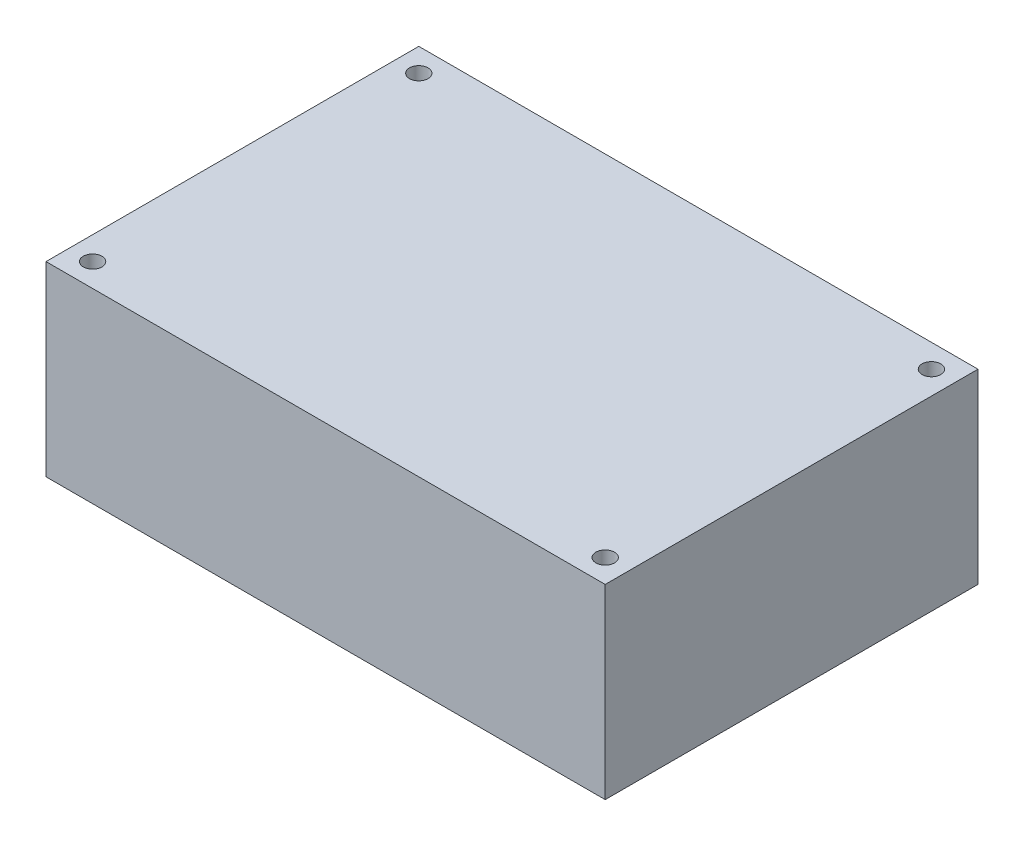
ISO-10303-21;
HEADER;
FILE_DESCRIPTION(('STEP AP214'),'2;1');
FILE_NAME('part.step','',(''),(''),'','','');
FILE_SCHEMA(('AUTOMOTIVE_DESIGN { 1 0 10303 214 1 1 1 1 }'));
ENDSEC;
DATA;
#1=APPLICATION_CONTEXT('core data for automotive mechanical design processes');
#2=APPLICATION_PROTOCOL_DEFINITION('international standard','automotive_design',2000,#1);
#3=PRODUCT_CONTEXT('',#1,'mechanical');
#4=PRODUCT('Part','Part','',(#3));
#5=PRODUCT_RELATED_PRODUCT_CATEGORY('part','',(#4));
#6=PRODUCT_DEFINITION_FORMATION('','',#4);
#7=PRODUCT_DEFINITION_CONTEXT('part definition',#1,'design');
#8=PRODUCT_DEFINITION('design','',#6,#7);
#9=PRODUCT_DEFINITION_SHAPE('','',#8);
#10=(LENGTH_UNIT() NAMED_UNIT(*) SI_UNIT(.MILLI.,.METRE.));
#11=(NAMED_UNIT(*) PLANE_ANGLE_UNIT() SI_UNIT($,.RADIAN.));
#12=(NAMED_UNIT(*) SI_UNIT($,.STERADIAN.) SOLID_ANGLE_UNIT());
#13=UNCERTAINTY_MEASURE_WITH_UNIT(LENGTH_MEASURE(1.E-05),#10,'distance_accuracy_value','');
#14=(GEOMETRIC_REPRESENTATION_CONTEXT(3) GLOBAL_UNCERTAINTY_ASSIGNED_CONTEXT((#13)) GLOBAL_UNIT_ASSIGNED_CONTEXT((#10,
#11,#12)) REPRESENTATION_CONTEXT('',''));
#15=CARTESIAN_POINT('',(0.,0.,0.));
#16=DIRECTION('',(0.,0.,1.));
#17=DIRECTION('',(1.,0.,0.));
#18=AXIS2_PLACEMENT_3D('',#15,#16,#17);
#19=CARTESIAN_POINT('',(0.,20.,0.));
#20=DIRECTION('',(0.,1.,0.));
#21=DIRECTION('',(0.,0.,1.));
#22=AXIS2_PLACEMENT_3D('',#19,#20,#21);
#23=PLANE('',#22);
#24=CARTESIAN_POINT('',(27.5,20.,17.5));
#25=DIRECTION('',(0.,1.,0.));
#26=DIRECTION('',(0.,0.,1.));
#27=AXIS2_PLACEMENT_3D('',#24,#25,#26);
#28=CIRCLE('',#27,1.);
#29=CARTESIAN_POINT('',(27.5,20.,18.5));
#30=VERTEX_POINT('',#29);
#31=EDGE_CURVE('E129',#30,#30,#28,.T.);
#32=ORIENTED_EDGE('',*,*,#31,.F.);
#33=EDGE_LOOP('',(#32));
#34=FACE_BOUND('',#33,.T.);
#35=CARTESIAN_POINT('',(-27.5,20.,-17.5));
#36=DIRECTION('',(0.,1.,0.));
#37=DIRECTION('',(0.,0.,1.));
#38=AXIS2_PLACEMENT_3D('',#35,#36,#37);
#39=CIRCLE('',#38,1.);
#40=CARTESIAN_POINT('',(-27.5,20.,-16.5));
#41=VERTEX_POINT('',#40);
#42=EDGE_CURVE('E108',#41,#41,#39,.T.);
#43=ORIENTED_EDGE('',*,*,#42,.F.);
#44=EDGE_LOOP('',(#43));
#45=FACE_BOUND('',#44,.T.);
#46=DIRECTION('',(0.,0.,-1.));
#47=VECTOR('',#46,1.);
#48=CARTESIAN_POINT('',(30.,20.,-20.));
#49=LINE('',#48,#47);
#50=CARTESIAN_POINT('',(30.,20.,20.));
#51=VERTEX_POINT('',#50);
#52=CARTESIAN_POINT('',(30.,20.,-20.));
#53=VERTEX_POINT('',#52);
#54=EDGE_CURVE('E93',#51,#53,#49,.T.);
#55=ORIENTED_EDGE('',*,*,#54,.T.);
#56=DIRECTION('',(-1.,0.,0.));
#57=VECTOR('',#56,1.);
#58=CARTESIAN_POINT('',(-30.,20.,-20.));
#59=LINE('',#58,#57);
#60=CARTESIAN_POINT('',(-30.,20.,-20.));
#61=VERTEX_POINT('',#60);
#62=EDGE_CURVE('E88',#53,#61,#59,.T.);
#63=ORIENTED_EDGE('',*,*,#62,.T.);
#64=DIRECTION('',(0.,0.,1.));
#65=VECTOR('',#64,1.);
#66=CARTESIAN_POINT('',(-30.,20.,-20.));
#67=LINE('',#66,#65);
#68=CARTESIAN_POINT('',(-30.,20.,20.));
#69=VERTEX_POINT('',#68);
#70=EDGE_CURVE('E91',#61,#69,#67,.T.);
#71=ORIENTED_EDGE('',*,*,#70,.T.);
#72=DIRECTION('',(1.,0.,0.));
#73=VECTOR('',#72,1.);
#74=CARTESIAN_POINT('',(-30.,20.,20.));
#75=LINE('',#74,#73);
#76=EDGE_CURVE('E58',#69,#51,#75,.T.);
#77=ORIENTED_EDGE('',*,*,#76,.T.);
#78=EDGE_LOOP('',(#55,#63,#71,#77));
#79=FACE_BOUND('',#78,.T.);
#80=CARTESIAN_POINT('',(27.5,20.,-17.5));
#81=DIRECTION('',(0.,1.,0.));
#82=DIRECTION('',(0.,0.,1.));
#83=AXIS2_PLACEMENT_3D('',#80,#81,#82);
#84=CIRCLE('',#83,1.);
#85=CARTESIAN_POINT('',(27.5,20.,-16.5));
#86=VERTEX_POINT('',#85);
#87=EDGE_CURVE('E123',#86,#86,#84,.T.);
#88=ORIENTED_EDGE('',*,*,#87,.F.);
#89=EDGE_LOOP('',(#88));
#90=FACE_BOUND('',#89,.T.);
#91=CARTESIAN_POINT('',(-27.5,20.,17.5));
#92=DIRECTION('',(0.,1.,0.));
#93=DIRECTION('',(0.,0.,1.));
#94=AXIS2_PLACEMENT_3D('',#91,#92,#93);
#95=CIRCLE('',#94,1.);
#96=CARTESIAN_POINT('',(-27.5,20.,18.5));
#97=VERTEX_POINT('',#96);
#98=EDGE_CURVE('E135',#97,#97,#95,.T.);
#99=ORIENTED_EDGE('',*,*,#98,.F.);
#100=EDGE_LOOP('',(#99));
#101=FACE_BOUND('',#100,.T.);
#102=ADVANCED_FACE('F41',(#34,#45,#79,#90,#101),#23,.T.);
#103=CARTESIAN_POINT('',(0.,0.,0.));
#104=DIRECTION('',(0.,1.,0.));
#105=DIRECTION('',(0.,0.,1.));
#106=AXIS2_PLACEMENT_3D('',#103,#104,#105);
#107=PLANE('',#106);
#108=DIRECTION('',(0.,0.,-1.));
#109=VECTOR('',#108,1.);
#110=CARTESIAN_POINT('',(30.,0.,-20.));
#111=LINE('',#110,#109);
#112=CARTESIAN_POINT('',(30.,0.,20.));
#113=VERTEX_POINT('',#112);
#114=CARTESIAN_POINT('',(30.,0.,-20.));
#115=VERTEX_POINT('',#114);
#116=EDGE_CURVE('E105',#113,#115,#111,.T.);
#117=ORIENTED_EDGE('',*,*,#116,.F.);
#118=DIRECTION('',(1.,0.,0.));
#119=VECTOR('',#118,1.);
#120=CARTESIAN_POINT('',(-30.,0.,20.));
#121=LINE('',#120,#119);
#122=CARTESIAN_POINT('',(-30.,0.,20.));
#123=VERTEX_POINT('',#122);
#124=EDGE_CURVE('E81',#123,#113,#121,.T.);
#125=ORIENTED_EDGE('',*,*,#124,.F.);
#126=DIRECTION('',(0.,0.,1.));
#127=VECTOR('',#126,1.);
#128=CARTESIAN_POINT('',(-30.,0.,-20.));
#129=LINE('',#128,#127);
#130=CARTESIAN_POINT('',(-30.,0.,-20.));
#131=VERTEX_POINT('',#130);
#132=EDGE_CURVE('E75',#131,#123,#129,.T.);
#133=ORIENTED_EDGE('',*,*,#132,.F.);
#134=DIRECTION('',(-1.,0.,0.));
#135=VECTOR('',#134,1.);
#136=CARTESIAN_POINT('',(-30.,0.,-20.));
#137=LINE('',#136,#135);
#138=EDGE_CURVE('E97',#115,#131,#137,.T.);
#139=ORIENTED_EDGE('',*,*,#138,.F.);
#140=EDGE_LOOP('',(#117,#125,#133,#139));
#141=FACE_BOUND('',#140,.T.);
#142=CARTESIAN_POINT('',(-27.5,0.,-17.5));
#143=DIRECTION('',(0.,1.,0.));
#144=DIRECTION('',(0.,0.,1.));
#145=AXIS2_PLACEMENT_3D('',#142,#143,#144);
#146=CIRCLE('',#145,1.);
#147=CARTESIAN_POINT('',(-27.5,0.,-16.5));
#148=VERTEX_POINT('',#147);
#149=EDGE_CURVE('E120',#148,#148,#146,.T.);
#150=ORIENTED_EDGE('',*,*,#149,.T.);
#151=EDGE_LOOP('',(#150));
#152=FACE_BOUND('',#151,.T.);
#153=CARTESIAN_POINT('',(27.5,0.,-17.5));
#154=DIRECTION('',(0.,1.,0.));
#155=DIRECTION('',(0.,0.,1.));
#156=AXIS2_PLACEMENT_3D('',#153,#154,#155);
#157=CIRCLE('',#156,1.);
#158=CARTESIAN_POINT('',(27.5,0.,-16.5));
#159=VERTEX_POINT('',#158);
#160=EDGE_CURVE('E126',#159,#159,#157,.T.);
#161=ORIENTED_EDGE('',*,*,#160,.T.);
#162=EDGE_LOOP('',(#161));
#163=FACE_BOUND('',#162,.T.);
#164=CARTESIAN_POINT('',(27.5,0.,17.5));
#165=DIRECTION('',(0.,1.,0.));
#166=DIRECTION('',(0.,0.,1.));
#167=AXIS2_PLACEMENT_3D('',#164,#165,#166);
#168=CIRCLE('',#167,1.);
#169=CARTESIAN_POINT('',(27.5,0.,18.5));
#170=VERTEX_POINT('',#169);
#171=EDGE_CURVE('E132',#170,#170,#168,.T.);
#172=ORIENTED_EDGE('',*,*,#171,.T.);
#173=EDGE_LOOP('',(#172));
#174=FACE_BOUND('',#173,.T.);
#175=CARTESIAN_POINT('',(-27.5,0.,17.5));
#176=DIRECTION('',(0.,1.,0.));
#177=DIRECTION('',(0.,0.,1.));
#178=AXIS2_PLACEMENT_3D('',#175,#176,#177);
#179=CIRCLE('',#178,1.);
#180=CARTESIAN_POINT('',(-27.5,0.,18.5));
#181=VERTEX_POINT('',#180);
#182=EDGE_CURVE('E138',#181,#181,#179,.T.);
#183=ORIENTED_EDGE('',*,*,#182,.T.);
#184=EDGE_LOOP('',(#183));
#185=FACE_BOUND('',#184,.T.);
#186=ADVANCED_FACE('F116',(#141,#152,#163,#174,#185),#107,.F.);
#187=CARTESIAN_POINT('',(30.,20.,-20.));
#188=DIRECTION('',(-1.,0.,0.));
#189=DIRECTION('',(0.,0.,1.));
#190=AXIS2_PLACEMENT_3D('',#187,#188,#189);
#191=PLANE('',#190);
#192=ORIENTED_EDGE('',*,*,#116,.T.);
#193=DIRECTION('',(0.,-1.,0.));
#194=VECTOR('',#193,1.);
#195=CARTESIAN_POINT('',(30.,20.,-20.));
#196=LINE('',#195,#194);
#197=EDGE_CURVE('E11',#53,#115,#196,.T.);
#198=ORIENTED_EDGE('',*,*,#197,.F.);
#199=ORIENTED_EDGE('',*,*,#54,.F.);
#200=DIRECTION('',(0.,-1.,0.));
#201=VECTOR('',#200,1.);
#202=CARTESIAN_POINT('',(30.,20.,20.));
#203=LINE('',#202,#201);
#204=EDGE_CURVE('E101',#51,#113,#203,.T.);
#205=ORIENTED_EDGE('',*,*,#204,.T.);
#206=EDGE_LOOP('',(#192,#198,#199,#205));
#207=FACE_BOUND('',#206,.T.);
#208=ADVANCED_FACE('F43',(#207),#191,.F.);
#209=CARTESIAN_POINT('',(-30.,20.,-20.));
#210=DIRECTION('',(0.,0.,1.));
#211=DIRECTION('',(1.,0.,0.));
#212=AXIS2_PLACEMENT_3D('',#209,#210,#211);
#213=PLANE('',#212);
#214=ORIENTED_EDGE('',*,*,#138,.T.);
#215=DIRECTION('',(0.,-1.,0.));
#216=VECTOR('',#215,1.);
#217=CARTESIAN_POINT('',(-30.,20.,-20.));
#218=LINE('',#217,#216);
#219=EDGE_CURVE('E50',#61,#131,#218,.T.);
#220=ORIENTED_EDGE('',*,*,#219,.F.);
#221=ORIENTED_EDGE('',*,*,#62,.F.);
#222=ORIENTED_EDGE('',*,*,#197,.T.);
#223=EDGE_LOOP('',(#214,#220,#221,#222));
#224=FACE_BOUND('',#223,.T.);
#225=ADVANCED_FACE('F96',(#224),#213,.F.);
#226=CARTESIAN_POINT('',(-30.,20.,-20.));
#227=DIRECTION('',(1.,0.,0.));
#228=DIRECTION('',(0.,0.,-1.));
#229=AXIS2_PLACEMENT_3D('',#226,#227,#228);
#230=PLANE('',#229);
#231=ORIENTED_EDGE('',*,*,#132,.T.);
#232=DIRECTION('',(0.,-1.,0.));
#233=VECTOR('',#232,1.);
#234=CARTESIAN_POINT('',(-30.,20.,20.));
#235=LINE('',#234,#233);
#236=EDGE_CURVE('E98',#69,#123,#235,.T.);
#237=ORIENTED_EDGE('',*,*,#236,.F.);
#238=ORIENTED_EDGE('',*,*,#70,.F.);
#239=ORIENTED_EDGE('',*,*,#219,.T.);
#240=EDGE_LOOP('',(#231,#237,#238,#239));
#241=FACE_BOUND('',#240,.T.);
#242=ADVANCED_FACE('F99',(#241),#230,.F.);
#243=CARTESIAN_POINT('',(-30.,20.,20.));
#244=DIRECTION('',(0.,0.,-1.));
#245=DIRECTION('',(-1.,0.,0.));
#246=AXIS2_PLACEMENT_3D('',#243,#244,#245);
#247=PLANE('',#246);
#248=ORIENTED_EDGE('',*,*,#124,.T.);
#249=ORIENTED_EDGE('',*,*,#204,.F.);
#250=ORIENTED_EDGE('',*,*,#76,.F.);
#251=ORIENTED_EDGE('',*,*,#236,.T.);
#252=EDGE_LOOP('',(#248,#249,#250,#251));
#253=FACE_BOUND('',#252,.T.);
#254=ADVANCED_FACE('F113',(#253),#247,.F.);
#255=CARTESIAN_POINT('',(-27.5,20.,-17.5));
#256=DIRECTION('',(0.,-1.,0.));
#257=DIRECTION('',(0.,0.,-1.));
#258=AXIS2_PLACEMENT_3D('',#255,#256,#257);
#259=CYLINDRICAL_SURFACE('',#258,1.);
#260=ORIENTED_EDGE('',*,*,#42,.T.);
#261=EDGE_LOOP('',(#260));
#262=FACE_BOUND('',#261,.T.);
#263=ORIENTED_EDGE('',*,*,#149,.F.);
#264=EDGE_LOOP('',(#263));
#265=FACE_BOUND('',#264,.T.);
#266=ADVANCED_FACE('F157',(#262,#265),#259,.F.);
#267=CARTESIAN_POINT('',(27.5,20.,-17.5));
#268=DIRECTION('',(0.,-1.,0.));
#269=DIRECTION('',(0.,0.,-1.));
#270=AXIS2_PLACEMENT_3D('',#267,#268,#269);
#271=CYLINDRICAL_SURFACE('',#270,1.);
#272=ORIENTED_EDGE('',*,*,#87,.T.);
#273=EDGE_LOOP('',(#272));
#274=FACE_BOUND('',#273,.T.);
#275=ORIENTED_EDGE('',*,*,#160,.F.);
#276=EDGE_LOOP('',(#275));
#277=FACE_BOUND('',#276,.T.);
#278=ADVANCED_FACE('F205',(#274,#277),#271,.F.);
#279=CARTESIAN_POINT('',(27.5,20.,17.5));
#280=DIRECTION('',(0.,-1.,0.));
#281=DIRECTION('',(0.,0.,-1.));
#282=AXIS2_PLACEMENT_3D('',#279,#280,#281);
#283=CYLINDRICAL_SURFACE('',#282,1.);
#284=ORIENTED_EDGE('',*,*,#31,.T.);
#285=EDGE_LOOP('',(#284));
#286=FACE_BOUND('',#285,.T.);
#287=ORIENTED_EDGE('',*,*,#171,.F.);
#288=EDGE_LOOP('',(#287));
#289=FACE_BOUND('',#288,.T.);
#290=ADVANCED_FACE('F213',(#286,#289),#283,.F.);
#291=CARTESIAN_POINT('',(-27.5,20.,17.5));
#292=DIRECTION('',(0.,-1.,0.));
#293=DIRECTION('',(0.,0.,-1.));
#294=AXIS2_PLACEMENT_3D('',#291,#292,#293);
#295=CYLINDRICAL_SURFACE('',#294,1.);
#296=ORIENTED_EDGE('',*,*,#98,.T.);
#297=EDGE_LOOP('',(#296));
#298=FACE_BOUND('',#297,.T.);
#299=ORIENTED_EDGE('',*,*,#182,.F.);
#300=EDGE_LOOP('',(#299));
#301=FACE_BOUND('',#300,.T.);
#302=ADVANCED_FACE('F144',(#298,#301),#295,.F.);
#303=CLOSED_SHELL('',(#102,#186,#208,#225,#242,#254,#266,#278,#290,#302));
#304=MANIFOLD_SOLID_BREP('B2',#303);
#305=ADVANCED_BREP_SHAPE_REPRESENTATION('',(#18,#304),#14);
#306=SHAPE_DEFINITION_REPRESENTATION(#9,#305);
ENDSEC;
END-ISO-10303-21;
